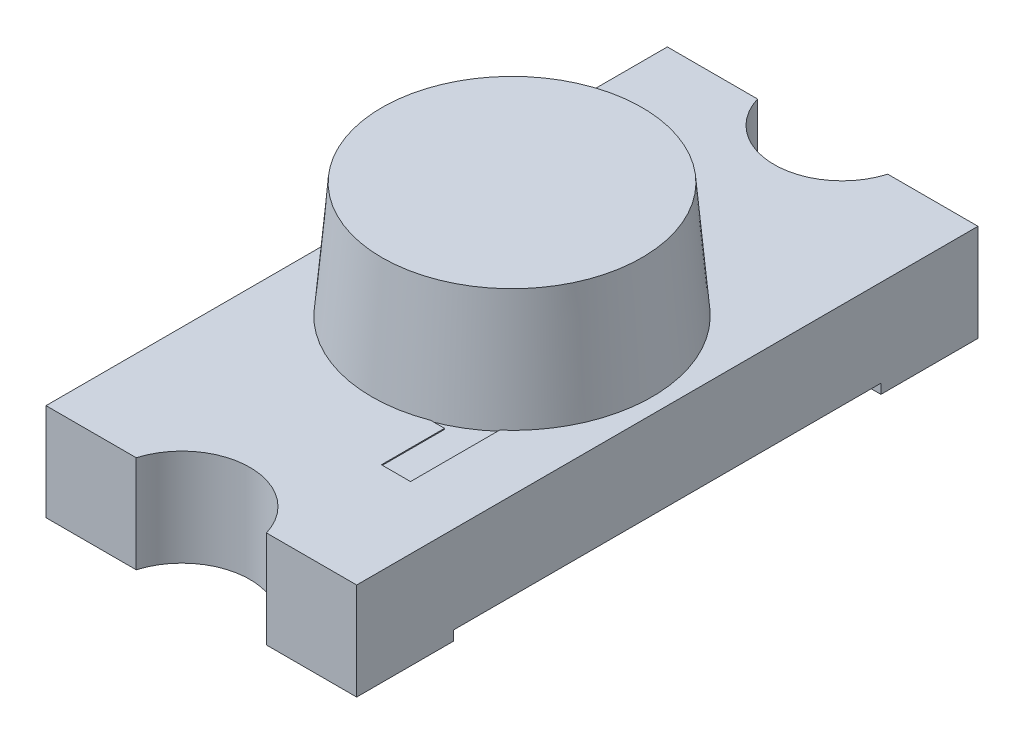
ISO-10303-21;
HEADER;
FILE_DESCRIPTION(('STEP AP214'),'2;1');
FILE_NAME('part.step','',(''),(''),'','','');
FILE_SCHEMA(('AUTOMOTIVE_DESIGN { 1 0 10303 214 1 1 1 1 }'));
ENDSEC;
DATA;
#1=APPLICATION_CONTEXT('core data for automotive mechanical design processes');
#2=APPLICATION_PROTOCOL_DEFINITION('international standard','automotive_design',2000,#1);
#3=PRODUCT_CONTEXT('',#1,'mechanical');
#4=PRODUCT('Part','Part','',(#3));
#5=PRODUCT_RELATED_PRODUCT_CATEGORY('part','',(#4));
#6=PRODUCT_DEFINITION_FORMATION('','',#4);
#7=PRODUCT_DEFINITION_CONTEXT('part definition',#1,'design');
#8=PRODUCT_DEFINITION('design','',#6,#7);
#9=PRODUCT_DEFINITION_SHAPE('','',#8);
#10=(LENGTH_UNIT() NAMED_UNIT(*) SI_UNIT(.MILLI.,.METRE.));
#11=(NAMED_UNIT(*) PLANE_ANGLE_UNIT() SI_UNIT($,.RADIAN.));
#12=(NAMED_UNIT(*) SI_UNIT($,.STERADIAN.) SOLID_ANGLE_UNIT());
#13=UNCERTAINTY_MEASURE_WITH_UNIT(LENGTH_MEASURE(1.E-05),#10,'distance_accuracy_value','');
#14=(GEOMETRIC_REPRESENTATION_CONTEXT(3) GLOBAL_UNCERTAINTY_ASSIGNED_CONTEXT((#13)) GLOBAL_UNIT_ASSIGNED_CONTEXT((#10,
#11,#12)) REPRESENTATION_CONTEXT('',''));
#15=CARTESIAN_POINT('',(0.,0.,0.));
#16=DIRECTION('',(0.,0.,1.));
#17=DIRECTION('',(1.,0.,0.));
#18=AXIS2_PLACEMENT_3D('',#15,#16,#17);
#19=CARTESIAN_POINT('',(0.,0.495,0.));
#20=DIRECTION('',(0.,-1.,0.));
#21=DIRECTION('',(0.,0.,1.));
#22=AXIS2_PLACEMENT_3D('',#19,#20,#21);
#23=CONICAL_SURFACE('',#22,0.722303878658216,0.0872664625997167);
#24=CARTESIAN_POINT('',(0.,1.095,0.));
#25=DIRECTION('',(0.,1.,0.));
#26=DIRECTION('',(0.,0.,1.));
#27=AXIS2_PLACEMENT_3D('',#24,#25,#26);
#28=CIRCLE('',#27,0.669810680542662);
#29=CARTESIAN_POINT('',(0.,1.095,0.669810680542662));
#30=VERTEX_POINT('',#29);
#31=EDGE_CURVE('E12',#30,#30,#28,.T.);
#32=ORIENTED_EDGE('',*,*,#31,.F.);
#33=EDGE_LOOP('',(#32));
#34=FACE_BOUND('',#33,.T.);
#35=CARTESIAN_POINT('',(0.,0.495,0.));
#36=DIRECTION('',(0.,1.,0.));
#37=DIRECTION('',(0.,0.,1.));
#38=AXIS2_PLACEMENT_3D('',#35,#36,#37);
#39=CIRCLE('',#38,0.722303878658216);
#40=CARTESIAN_POINT('',(0.,0.495,0.722303878658216));
#41=VERTEX_POINT('',#40);
#42=EDGE_CURVE('E50',#41,#41,#39,.T.);
#43=ORIENTED_EDGE('',*,*,#42,.T.);
#44=EDGE_LOOP('',(#43));
#45=FACE_BOUND('',#44,.T.);
#46=ADVANCED_FACE('F44',(#34,#45),#23,.T.);
#47=CARTESIAN_POINT('',(0.,1.095,0.));
#48=DIRECTION('',(0.,1.,0.));
#49=DIRECTION('',(0.,0.,1.));
#50=AXIS2_PLACEMENT_3D('',#47,#48,#49);
#51=PLANE('',#50);
#52=ORIENTED_EDGE('',*,*,#31,.T.);
#53=EDGE_LOOP('',(#52));
#54=FACE_BOUND('',#53,.T.);
#55=ADVANCED_FACE('F59',(#54),#51,.T.);
#56=CARTESIAN_POINT('',(0.,0.495,0.));
#57=DIRECTION('',(0.,1.,0.));
#58=DIRECTION('',(0.,0.,1.));
#59=AXIS2_PLACEMENT_3D('',#56,#57,#58);
#60=PLANE('',#59);
#61=ORIENTED_EDGE('',*,*,#42,.F.);
#62=EDGE_LOOP('',(#61));
#63=FACE_BOUND('',#62,.T.);
#64=ADVANCED_FACE('F57',(#63),#60,.F.);
#65=CLOSED_SHELL('',(#46,#55,#64));
#66=MANIFOLD_SOLID_BREP('B2',#65);
#67=CARTESIAN_POINT('',(-2.92422569718548,0.495,0.));
#68=DIRECTION('',(0.,1.,0.));
#69=DIRECTION('',(0.,0.,1.));
#70=AXIS2_PLACEMENT_3D('',#67,#68,#69);
#71=PLANE('',#70);
#72=DIRECTION('',(0.,0.,1.));
#73=VECTOR('',#72,1.);
#74=CARTESIAN_POINT('',(0.477379024541812,0.495,0.));
#75=LINE('',#74,#73);
#76=CARTESIAN_POINT('',(0.477379024541812,0.495,0.525));
#77=VERTEX_POINT('',#76);
#78=CARTESIAN_POINT('',(0.477379024541812,0.495,1.));
#79=VERTEX_POINT('',#78);
#80=EDGE_CURVE('E366',#77,#79,#75,.T.);
#81=ORIENTED_EDGE('',*,*,#80,.F.);
#82=DIRECTION('',(1.,0.,0.));
#83=VECTOR('',#82,1.);
#84=CARTESIAN_POINT('',(-2.92422569718548,0.495,0.525));
#85=LINE('',#84,#83);
#86=CARTESIAN_POINT('',(-0.075,0.495,0.525));
#87=VERTEX_POINT('',#86);
#88=EDGE_CURVE('E368',#87,#77,#85,.T.);
#89=ORIENTED_EDGE('',*,*,#88,.F.);
#90=DIRECTION('',(0.,0.,1.));
#91=VECTOR('',#90,1.);
#92=CARTESIAN_POINT('',(-0.075,0.495,0.));
#93=LINE('',#92,#91);
#94=CARTESIAN_POINT('',(-0.075,0.495,0.225));
#95=VERTEX_POINT('',#94);
#96=EDGE_CURVE('E371',#95,#87,#93,.T.);
#97=ORIENTED_EDGE('',*,*,#96,.F.);
#98=DIRECTION('',(1.,0.,0.));
#99=VECTOR('',#98,1.);
#100=CARTESIAN_POINT('',(-2.92422569718548,0.495,0.225000000000001));
#101=LINE('',#100,#99);
#102=CARTESIAN_POINT('',(0.225,0.495,0.225));
#103=VERTEX_POINT('',#102);
#104=EDGE_CURVE('E373',#95,#103,#101,.T.);
#105=ORIENTED_EDGE('',*,*,#104,.T.);
#106=DIRECTION('',(0.,0.,1.));
#107=VECTOR('',#106,1.);
#108=CARTESIAN_POINT('',(0.225,0.495,0.));
#109=LINE('',#108,#107);
#110=CARTESIAN_POINT('',(0.225,0.495,-0.225));
#111=VERTEX_POINT('',#110);
#112=EDGE_CURVE('E376',#111,#103,#109,.T.);
#113=ORIENTED_EDGE('',*,*,#112,.F.);
#114=DIRECTION('',(1.,0.,0.));
#115=VECTOR('',#114,1.);
#116=CARTESIAN_POINT('',(-2.92422569718548,0.495,-0.225));
#117=LINE('',#116,#115);
#118=CARTESIAN_POINT('',(-0.225,0.495,-0.225));
#119=VERTEX_POINT('',#118);
#120=EDGE_CURVE('E378',#119,#111,#117,.T.);
#121=ORIENTED_EDGE('',*,*,#120,.F.);
#122=DIRECTION('',(0.,0.,1.));
#123=VECTOR('',#122,1.);
#124=CARTESIAN_POINT('',(-0.225,0.495,0.));
#125=LINE('',#124,#123);
#126=CARTESIAN_POINT('',(-0.225,0.495,0.675));
#127=VERTEX_POINT('',#126);
#128=EDGE_CURVE('E380',#119,#127,#125,.T.);
#129=ORIENTED_EDGE('',*,*,#128,.T.);
#130=DIRECTION('',(1.,0.,0.));
#131=VECTOR('',#130,1.);
#132=CARTESIAN_POINT('',(-2.92422569718548,0.495,0.675));
#133=LINE('',#132,#131);
#134=CARTESIAN_POINT('',(0.327379024541811,0.495,0.675));
#135=VERTEX_POINT('',#134);
#136=EDGE_CURVE('E383',#127,#135,#133,.T.);
#137=ORIENTED_EDGE('',*,*,#136,.T.);
#138=DIRECTION('',(0.,0.,1.));
#139=VECTOR('',#138,1.);
#140=CARTESIAN_POINT('',(0.327379024541812,0.495,0.));
#141=LINE('',#140,#139);
#142=CARTESIAN_POINT('',(0.327379024541812,0.495,1.));
#143=VERTEX_POINT('',#142);
#144=EDGE_CURVE('E386',#135,#143,#141,.T.);
#145=ORIENTED_EDGE('',*,*,#144,.T.);
#146=DIRECTION('',(1.,0.,0.));
#147=VECTOR('',#146,1.);
#148=CARTESIAN_POINT('',(-2.92422569718548,0.495,1.));
#149=LINE('',#148,#147);
#150=EDGE_CURVE('E389',#143,#79,#149,.T.);
#151=ORIENTED_EDGE('',*,*,#150,.T.);
#152=EDGE_LOOP('',(#81,#89,#97,#105,#113,#121,#129,#137,#145,#151));
#153=FACE_BOUND('',#152,.T.);
#154=DIRECTION('',(1.,0.,0.));
#155=VECTOR('',#154,1.);
#156=CARTESIAN_POINT('',(-0.195,0.495,0.195));
#157=LINE('',#156,#155);
#158=CARTESIAN_POINT('',(-0.195,0.495,0.195));
#159=VERTEX_POINT('',#158);
#160=CARTESIAN_POINT('',(0.195,0.495,0.195));
#161=VERTEX_POINT('',#160);
#162=EDGE_CURVE('E961',#159,#161,#157,.T.);
#163=ORIENTED_EDGE('',*,*,#162,.F.);
#164=DIRECTION('',(0.,0.,1.));
#165=VECTOR('',#164,1.);
#166=CARTESIAN_POINT('',(-0.195,0.495,-0.195));
#167=LINE('',#166,#165);
#168=CARTESIAN_POINT('',(-0.195,0.495,-0.195));
#169=VERTEX_POINT('',#168);
#170=EDGE_CURVE('E316',#169,#159,#167,.T.);
#171=ORIENTED_EDGE('',*,*,#170,.F.);
#172=DIRECTION('',(-1.,0.,0.));
#173=VECTOR('',#172,1.);
#174=CARTESIAN_POINT('',(-0.195,0.495,-0.195));
#175=LINE('',#174,#173);
#176=CARTESIAN_POINT('',(0.195,0.495,-0.195));
#177=VERTEX_POINT('',#176);
#178=EDGE_CURVE('E312',#177,#169,#175,.T.);
#179=ORIENTED_EDGE('',*,*,#178,.F.);
#180=DIRECTION('',(0.,0.,-1.));
#181=VECTOR('',#180,1.);
#182=CARTESIAN_POINT('',(0.195,0.495,-0.195));
#183=LINE('',#182,#181);
#184=EDGE_CURVE('E958',#161,#177,#183,.T.);
#185=ORIENTED_EDGE('',*,*,#184,.F.);
#186=EDGE_LOOP('',(#163,#171,#179,#185));
#187=FACE_BOUND('',#186,.T.);
#188=ADVANCED_FACE('F85',(#153,#187),#71,.T.);
#189=CARTESIAN_POINT('',(0.8,0.5,1.6));
#190=DIRECTION('',(0.,-1.,0.));
#191=DIRECTION('',(0.,0.,-1.));
#192=AXIS2_PLACEMENT_3D('',#189,#190,#191);
#193=PLANE('',#192);
#194=DIRECTION('',(0.,0.,-1.));
#195=VECTOR('',#194,1.);
#196=CARTESIAN_POINT('',(0.276447509101705,0.5,0.));
#197=LINE('',#196,#195);
#198=CARTESIAN_POINT('',(0.276447509101705,0.5,-0.450698671652405));
#199=VERTEX_POINT('',#198);
#200=CARTESIAN_POINT('',(0.276447509101705,0.5,-0.630698671652405));
#201=VERTEX_POINT('',#200);
#202=EDGE_CURVE('E319',#199,#201,#197,.T.);
#203=ORIENTED_EDGE('',*,*,#202,.F.);
#204=DIRECTION('',(1.,0.,0.));
#205=VECTOR('',#204,1.);
#206=CARTESIAN_POINT('',(-2.92422569718548,0.5,-0.450698671652405));
#207=LINE('',#206,#205);
#208=CARTESIAN_POINT('',(-0.457414609839892,0.5,-0.450698671652405));
#209=VERTEX_POINT('',#208);
#210=EDGE_CURVE('E108',#209,#199,#207,.T.);
#211=ORIENTED_EDGE('',*,*,#210,.F.);
#212=DIRECTION('',(0.,0.,1.));
#213=VECTOR('',#212,1.);
#214=CARTESIAN_POINT('',(-0.457414609839892,0.5,0.));
#215=LINE('',#214,#213);
#216=CARTESIAN_POINT('',(-0.457414609839892,0.5,-1.));
#217=VERTEX_POINT('',#216);
#218=EDGE_CURVE('E328',#217,#209,#215,.T.);
#219=ORIENTED_EDGE('',*,*,#218,.F.);
#220=DIRECTION('',(1.,0.,0.));
#221=VECTOR('',#220,1.);
#222=CARTESIAN_POINT('',(-2.92422569718548,0.5,-1.));
#223=LINE('',#222,#221);
#224=CARTESIAN_POINT('',(-0.277414609839892,0.5,-1.));
#225=VERTEX_POINT('',#224);
#226=EDGE_CURVE('E349',#217,#225,#223,.T.);
#227=ORIENTED_EDGE('',*,*,#226,.T.);
#228=DIRECTION('',(0.,0.,1.));
#229=VECTOR('',#228,1.);
#230=CARTESIAN_POINT('',(-0.277414609839892,0.5,0.));
#231=LINE('',#230,#229);
#232=CARTESIAN_POINT('',(-0.277414609839892,0.5,-0.630698671652405));
#233=VERTEX_POINT('',#232);
#234=EDGE_CURVE('E346',#225,#233,#231,.T.);
#235=ORIENTED_EDGE('',*,*,#234,.T.);
#236=DIRECTION('',(1.,0.,0.));
#237=VECTOR('',#236,1.);
#238=CARTESIAN_POINT('',(-2.92422569718548,0.5,-0.630698671652405));
#239=LINE('',#238,#237);
#240=EDGE_CURVE('E343',#233,#201,#239,.T.);
#241=ORIENTED_EDGE('',*,*,#240,.T.);
#242=EDGE_LOOP('',(#203,#211,#219,#227,#235,#241));
#243=FACE_BOUND('',#242,.T.);
#244=CARTESIAN_POINT('',(0.,0.500000000000001,1.7));
#245=DIRECTION('',(0.,1.,0.));
#246=DIRECTION('',(0.,0.,1.));
#247=AXIS2_PLACEMENT_3D('',#244,#245,#246);
#248=CIRCLE('',#247,0.35);
#249=CARTESIAN_POINT('',(0.335410196624969,0.500000000000001,1.6));
#250=VERTEX_POINT('',#249);
#251=CARTESIAN_POINT('',(-0.335410196624969,0.500000000000001,1.6));
#252=VERTEX_POINT('',#251);
#253=EDGE_CURVE('E442',#250,#252,#248,.T.);
#254=ORIENTED_EDGE('',*,*,#253,.F.);
#255=DIRECTION('',(-1.,0.,0.));
#256=VECTOR('',#255,1.);
#257=CARTESIAN_POINT('',(0.8,0.5,1.6));
#258=LINE('',#257,#256);
#259=CARTESIAN_POINT('',(0.8,0.5,1.6));
#260=VERTEX_POINT('',#259);
#261=EDGE_CURVE('E499',#260,#250,#258,.T.);
#262=ORIENTED_EDGE('',*,*,#261,.F.);
#263=DIRECTION('',(0.,0.,1.));
#264=VECTOR('',#263,1.);
#265=CARTESIAN_POINT('',(0.8,0.5,1.6));
#266=LINE('',#265,#264);
#267=CARTESIAN_POINT('',(0.8,0.500000000000001,-1.6));
#268=VERTEX_POINT('',#267);
#269=EDGE_CURVE('E496',#268,#260,#266,.T.);
#270=ORIENTED_EDGE('',*,*,#269,.F.);
#271=DIRECTION('',(-1.,0.,0.));
#272=VECTOR('',#271,1.);
#273=CARTESIAN_POINT('',(0.8,0.500000000000001,-1.6));
#274=LINE('',#273,#272);
#275=CARTESIAN_POINT('',(0.335410196624969,0.500000000000001,-1.6));
#276=VERTEX_POINT('',#275);
#277=EDGE_CURVE('E503',#268,#276,#274,.T.);
#278=ORIENTED_EDGE('',*,*,#277,.T.);
#279=CARTESIAN_POINT('',(0.,0.500000000000001,-1.7));
#280=DIRECTION('',(0.,-1.,0.));
#281=DIRECTION('',(0.,0.,-1.));
#282=AXIS2_PLACEMENT_3D('',#279,#280,#281);
#283=CIRCLE('',#282,0.35);
#284=CARTESIAN_POINT('',(-0.335410196624969,0.500000000000001,-1.6));
#285=VERTEX_POINT('',#284);
#286=EDGE_CURVE('E42',#285,#276,#283,.F.);
#287=ORIENTED_EDGE('',*,*,#286,.F.);
#288=CARTESIAN_POINT('',(-0.8,0.500000000000001,-1.6));
#289=VERTEX_POINT('',#288);
#290=EDGE_CURVE('E502',#285,#289,#274,.T.);
#291=ORIENTED_EDGE('',*,*,#290,.T.);
#292=DIRECTION('',(0.,0.,1.));
#293=VECTOR('',#292,1.);
#294=CARTESIAN_POINT('',(-0.8,0.5,1.6));
#295=LINE('',#294,#293);
#296=CARTESIAN_POINT('',(-0.8,0.5,1.6));
#297=VERTEX_POINT('',#296);
#298=EDGE_CURVE('E478',#289,#297,#295,.T.);
#299=ORIENTED_EDGE('',*,*,#298,.T.);
#300=EDGE_CURVE('E498',#252,#297,#258,.T.);
#301=ORIENTED_EDGE('',*,*,#300,.F.);
#302=EDGE_LOOP('',(#254,#262,#270,#278,#287,#291,#299,#301));
#303=FACE_BOUND('',#302,.T.);
#304=DIRECTION('',(0.,0.,1.));
#305=VECTOR('',#304,1.);
#306=CARTESIAN_POINT('',(0.477379024541812,0.5,0.));
#307=LINE('',#306,#305);
#308=CARTESIAN_POINT('',(0.477379024541812,0.5,0.525));
#309=VERTEX_POINT('',#308);
#310=CARTESIAN_POINT('',(0.477379024541812,0.5,1.));
#311=VERTEX_POINT('',#310);
#312=EDGE_CURVE('E356',#309,#311,#307,.T.);
#313=ORIENTED_EDGE('',*,*,#312,.T.);
#314=DIRECTION('',(1.,0.,0.));
#315=VECTOR('',#314,1.);
#316=CARTESIAN_POINT('',(-2.92422569718548,0.5,1.));
#317=LINE('',#316,#315);
#318=CARTESIAN_POINT('',(0.327379024541812,0.5,1.));
#319=VERTEX_POINT('',#318);
#320=EDGE_CURVE('E369',#319,#311,#317,.T.);
#321=ORIENTED_EDGE('',*,*,#320,.F.);
#322=DIRECTION('',(0.,0.,1.));
#323=VECTOR('',#322,1.);
#324=CARTESIAN_POINT('',(0.327379024541812,0.5,0.));
#325=LINE('',#324,#323);
#326=CARTESIAN_POINT('',(0.327379024541811,0.5,0.675));
#327=VERTEX_POINT('',#326);
#328=EDGE_CURVE('E416',#327,#319,#325,.T.);
#329=ORIENTED_EDGE('',*,*,#328,.F.);
#330=DIRECTION('',(1.,0.,0.));
#331=VECTOR('',#330,1.);
#332=CARTESIAN_POINT('',(-2.92422569718548,0.5,0.675));
#333=LINE('',#332,#331);
#334=CARTESIAN_POINT('',(-0.225,0.5,0.675));
#335=VERTEX_POINT('',#334);
#336=EDGE_CURVE('E413',#335,#327,#333,.T.);
#337=ORIENTED_EDGE('',*,*,#336,.F.);
#338=DIRECTION('',(0.,0.,1.));
#339=VECTOR('',#338,1.);
#340=CARTESIAN_POINT('',(-0.225,0.5,0.));
#341=LINE('',#340,#339);
#342=CARTESIAN_POINT('',(-0.225,0.5,-0.225));
#343=VERTEX_POINT('',#342);
#344=EDGE_CURVE('E410',#343,#335,#341,.T.);
#345=ORIENTED_EDGE('',*,*,#344,.F.);
#346=DIRECTION('',(1.,0.,0.));
#347=VECTOR('',#346,1.);
#348=CARTESIAN_POINT('',(-2.92422569718548,0.5,-0.225));
#349=LINE('',#348,#347);
#350=CARTESIAN_POINT('',(0.225,0.5,-0.225));
#351=VERTEX_POINT('',#350);
#352=EDGE_CURVE('E407',#343,#351,#349,.T.);
#353=ORIENTED_EDGE('',*,*,#352,.T.);
#354=DIRECTION('',(0.,0.,1.));
#355=VECTOR('',#354,1.);
#356=CARTESIAN_POINT('',(0.225,0.5,0.));
#357=LINE('',#356,#355);
#358=CARTESIAN_POINT('',(0.225,0.5,0.225));
#359=VERTEX_POINT('',#358);
#360=EDGE_CURVE('E404',#351,#359,#357,.T.);
#361=ORIENTED_EDGE('',*,*,#360,.T.);
#362=DIRECTION('',(1.,0.,0.));
#363=VECTOR('',#362,1.);
#364=CARTESIAN_POINT('',(-2.92422569718548,0.5,0.225000000000001));
#365=LINE('',#364,#363);
#366=CARTESIAN_POINT('',(-0.075,0.5,0.225));
#367=VERTEX_POINT('',#366);
#368=EDGE_CURVE('E401',#367,#359,#365,.T.);
#369=ORIENTED_EDGE('',*,*,#368,.F.);
#370=DIRECTION('',(0.,0.,1.));
#371=VECTOR('',#370,1.);
#372=CARTESIAN_POINT('',(-0.075,0.5,0.));
#373=LINE('',#372,#371);
#374=CARTESIAN_POINT('',(-0.075,0.5,0.525));
#375=VERTEX_POINT('',#374);
#376=EDGE_CURVE('E398',#367,#375,#373,.T.);
#377=ORIENTED_EDGE('',*,*,#376,.T.);
#378=DIRECTION('',(1.,0.,0.));
#379=VECTOR('',#378,1.);
#380=CARTESIAN_POINT('',(-2.92422569718548,0.5,0.525));
#381=LINE('',#380,#379);
#382=EDGE_CURVE('E395',#375,#309,#381,.T.);
#383=ORIENTED_EDGE('',*,*,#382,.T.);
#384=EDGE_LOOP('',(#313,#321,#329,#337,#345,#353,#361,#369,#377,#383));
#385=FACE_BOUND('',#384,.T.);
#386=ADVANCED_FACE('F537',(#243,#303,#385),#193,.F.);
#387=CARTESIAN_POINT('',(0.8,0.5,1.6));
#388=DIRECTION('',(0.,0.,-1.));
#389=DIRECTION('',(0.,1.,0.));
#390=AXIS2_PLACEMENT_3D('',#387,#388,#389);
#391=PLANE('',#390);
#392=DIRECTION('',(0.,-1.,0.));
#393=VECTOR('',#392,1.);
#394=CARTESIAN_POINT('',(0.335410196624969,0.500000000000001,1.6));
#395=LINE('',#394,#393);
#396=CARTESIAN_POINT('',(0.335410196624969,0.,1.6));
#397=VERTEX_POINT('',#396);
#398=EDGE_CURVE('E448',#397,#250,#395,.F.);
#399=ORIENTED_EDGE('',*,*,#398,.F.);
#400=DIRECTION('',(-1.,0.,0.));
#401=VECTOR('',#400,1.);
#402=CARTESIAN_POINT('',(0.8,0.,1.6));
#403=LINE('',#402,#401);
#404=CARTESIAN_POINT('',(0.8,0.,1.6));
#405=VERTEX_POINT('',#404);
#406=EDGE_CURVE('E93',#405,#397,#403,.T.);
#407=ORIENTED_EDGE('',*,*,#406,.F.);
#408=DIRECTION('',(0.,-1.,0.));
#409=VECTOR('',#408,1.);
#410=CARTESIAN_POINT('',(0.8,0.5,1.6));
#411=LINE('',#410,#409);
#412=EDGE_CURVE('E481',#260,#405,#411,.T.);
#413=ORIENTED_EDGE('',*,*,#412,.F.);
#414=ORIENTED_EDGE('',*,*,#261,.T.);
#415=EDGE_LOOP('',(#399,#407,#413,#414));
#416=FACE_BOUND('',#415,.T.);
#417=ADVANCED_FACE('F87',(#416),#391,.F.);
#418=DIRECTION('',(0.,-1.,0.));
#419=VECTOR('',#418,1.);
#420=CARTESIAN_POINT('',(-0.335410196624969,0.500000000000001,1.6));
#421=LINE('',#420,#419);
#422=CARTESIAN_POINT('',(-0.335410196624969,0.,1.6));
#423=VERTEX_POINT('',#422);
#424=EDGE_CURVE('E444',#252,#423,#421,.T.);
#425=ORIENTED_EDGE('',*,*,#424,.F.);
#426=ORIENTED_EDGE('',*,*,#300,.T.);
#427=DIRECTION('',(0.,-1.,0.));
#428=VECTOR('',#427,1.);
#429=CARTESIAN_POINT('',(-0.8,0.5,1.6));
#430=LINE('',#429,#428);
#431=CARTESIAN_POINT('',(-0.8,0.,1.6));
#432=VERTEX_POINT('',#431);
#433=EDGE_CURVE('E457',#297,#432,#430,.T.);
#434=ORIENTED_EDGE('',*,*,#433,.T.);
#435=EDGE_CURVE('E517',#423,#432,#403,.T.);
#436=ORIENTED_EDGE('',*,*,#435,.F.);
#437=EDGE_LOOP('',(#425,#426,#434,#436));
#438=FACE_BOUND('',#437,.T.);
#439=ADVANCED_FACE('F533',(#438),#391,.F.);
#440=CARTESIAN_POINT('',(0.8,0.,1.6));
#441=DIRECTION('',(0.,1.,0.));
#442=DIRECTION('',(0.,0.,1.));
#443=AXIS2_PLACEMENT_3D('',#440,#441,#442);
#444=PLANE('',#443);
#445=CARTESIAN_POINT('',(0.,0.,1.7));
#446=DIRECTION('',(0.,1.,0.));
#447=DIRECTION('',(0.,0.,1.));
#448=AXIS2_PLACEMENT_3D('',#445,#446,#447);
#449=CIRCLE('',#448,0.35);
#450=EDGE_CURVE('E423',#397,#423,#449,.T.);
#451=ORIENTED_EDGE('',*,*,#450,.T.);
#452=ORIENTED_EDGE('',*,*,#435,.T.);
#453=DIRECTION('',(0.,0.,-1.));
#454=VECTOR('',#453,1.);
#455=CARTESIAN_POINT('',(-0.8,0.,1.6));
#456=LINE('',#455,#454);
#457=CARTESIAN_POINT('',(-0.8,0.,1.1));
#458=VERTEX_POINT('',#457);
#459=EDGE_CURVE('E460',#432,#458,#456,.T.);
#460=ORIENTED_EDGE('',*,*,#459,.T.);
#461=DIRECTION('',(-1.,0.,0.));
#462=VECTOR('',#461,1.);
#463=CARTESIAN_POINT('',(0.8,0.,1.1));
#464=LINE('',#463,#462);
#465=CARTESIAN_POINT('',(0.8,0.,1.1));
#466=VERTEX_POINT('',#465);
#467=EDGE_CURVE('E516',#466,#458,#464,.T.);
#468=ORIENTED_EDGE('',*,*,#467,.F.);
#469=DIRECTION('',(0.,0.,-1.));
#470=VECTOR('',#469,1.);
#471=CARTESIAN_POINT('',(0.8,0.,1.6));
#472=LINE('',#471,#470);
#473=EDGE_CURVE('E484',#405,#466,#472,.T.);
#474=ORIENTED_EDGE('',*,*,#473,.F.);
#475=ORIENTED_EDGE('',*,*,#406,.T.);
#476=EDGE_LOOP('',(#451,#452,#460,#468,#474,#475));
#477=FACE_BOUND('',#476,.T.);
#478=ADVANCED_FACE('F523',(#477),#444,.F.);
#479=CARTESIAN_POINT('',(0.8,0.,-1.1));
#480=DIRECTION('',(0.,1.,0.));
#481=DIRECTION('',(0.,0.,1.));
#482=AXIS2_PLACEMENT_3D('',#479,#480,#481);
#483=PLANE('',#482);
#484=CARTESIAN_POINT('',(0.,0.,-1.7));
#485=DIRECTION('',(0.,1.,0.));
#486=DIRECTION('',(0.,0.,1.));
#487=AXIS2_PLACEMENT_3D('',#484,#485,#486);
#488=CIRCLE('',#487,0.35);
#489=CARTESIAN_POINT('',(-0.335410196624969,0.,-1.6));
#490=VERTEX_POINT('',#489);
#491=CARTESIAN_POINT('',(0.335410196624969,0.,-1.6));
#492=VERTEX_POINT('',#491);
#493=EDGE_CURVE('E450',#490,#492,#488,.T.);
#494=ORIENTED_EDGE('',*,*,#493,.T.);
#495=DIRECTION('',(-1.,0.,0.));
#496=VECTOR('',#495,1.);
#497=CARTESIAN_POINT('',(0.8,0.,-1.6));
#498=LINE('',#497,#496);
#499=CARTESIAN_POINT('',(0.8,0.,-1.6));
#500=VERTEX_POINT('',#499);
#501=EDGE_CURVE('E507',#500,#492,#498,.T.);
#502=ORIENTED_EDGE('',*,*,#501,.F.);
#503=DIRECTION('',(0.,0.,-1.));
#504=VECTOR('',#503,1.);
#505=CARTESIAN_POINT('',(0.8,0.,-1.1));
#506=LINE('',#505,#504);
#507=CARTESIAN_POINT('',(0.8,0.,-1.1));
#508=VERTEX_POINT('',#507);
#509=EDGE_CURVE('E492',#508,#500,#506,.T.);
#510=ORIENTED_EDGE('',*,*,#509,.F.);
#511=DIRECTION('',(-1.,0.,0.));
#512=VECTOR('',#511,1.);
#513=CARTESIAN_POINT('',(0.8,0.,-1.1));
#514=LINE('',#513,#512);
#515=CARTESIAN_POINT('',(-0.8,0.,-1.1));
#516=VERTEX_POINT('',#515);
#517=EDGE_CURVE('E510',#508,#516,#514,.T.);
#518=ORIENTED_EDGE('',*,*,#517,.T.);
#519=DIRECTION('',(0.,0.,-1.));
#520=VECTOR('',#519,1.);
#521=CARTESIAN_POINT('',(-0.8,0.,-1.1));
#522=LINE('',#521,#520);
#523=CARTESIAN_POINT('',(-0.8,0.,-1.6));
#524=VERTEX_POINT('',#523);
#525=EDGE_CURVE('E472',#516,#524,#522,.T.);
#526=ORIENTED_EDGE('',*,*,#525,.T.);
#527=EDGE_CURVE('E506',#490,#524,#498,.T.);
#528=ORIENTED_EDGE('',*,*,#527,.F.);
#529=EDGE_LOOP('',(#494,#502,#510,#518,#526,#528));
#530=FACE_BOUND('',#529,.T.);
#531=ADVANCED_FACE('F548',(#530),#483,.F.);
#532=CARTESIAN_POINT('',(0.8,0.500000000000001,-1.6));
#533=DIRECTION('',(0.,0.,1.));
#534=DIRECTION('',(0.,-1.,0.));
#535=AXIS2_PLACEMENT_3D('',#532,#533,#534);
#536=PLANE('',#535);
#537=DIRECTION('',(0.,-1.,0.));
#538=VECTOR('',#537,1.);
#539=CARTESIAN_POINT('',(-0.335410196624969,0.500000000000001,-1.6));
#540=LINE('',#539,#538);
#541=EDGE_CURVE('E455',#490,#285,#540,.F.);
#542=ORIENTED_EDGE('',*,*,#541,.F.);
#543=ORIENTED_EDGE('',*,*,#527,.T.);
#544=DIRECTION('',(0.,1.,0.));
#545=VECTOR('',#544,1.);
#546=CARTESIAN_POINT('',(-0.8,0.500000000000001,-1.6));
#547=LINE('',#546,#545);
#548=EDGE_CURVE('E475',#524,#289,#547,.T.);
#549=ORIENTED_EDGE('',*,*,#548,.T.);
#550=ORIENTED_EDGE('',*,*,#290,.F.);
#551=EDGE_LOOP('',(#542,#543,#549,#550));
#552=FACE_BOUND('',#551,.T.);
#553=ADVANCED_FACE('F863',(#552),#536,.F.);
#554=DIRECTION('',(0.,-1.,0.));
#555=VECTOR('',#554,1.);
#556=CARTESIAN_POINT('',(0.335410196624969,0.500000000000001,-1.6));
#557=LINE('',#556,#555);
#558=EDGE_CURVE('E453',#276,#492,#557,.T.);
#559=ORIENTED_EDGE('',*,*,#558,.F.);
#560=ORIENTED_EDGE('',*,*,#277,.F.);
#561=DIRECTION('',(0.,1.,0.));
#562=VECTOR('',#561,1.);
#563=CARTESIAN_POINT('',(0.8,0.500000000000001,-1.6));
#564=LINE('',#563,#562);
#565=EDGE_CURVE('E494',#500,#268,#564,.T.);
#566=ORIENTED_EDGE('',*,*,#565,.F.);
#567=ORIENTED_EDGE('',*,*,#501,.T.);
#568=EDGE_LOOP('',(#559,#560,#566,#567));
#569=FACE_BOUND('',#568,.T.);
#570=ADVANCED_FACE('F858',(#569),#536,.F.);
#571=CARTESIAN_POINT('',(0.8,0.0500000000000005,1.1));
#572=DIRECTION('',(0.,0.,1.));
#573=DIRECTION('',(1.,0.,0.));
#574=AXIS2_PLACEMENT_3D('',#571,#572,#573);
#575=PLANE('',#574);
#576=ORIENTED_EDGE('',*,*,#467,.T.);
#577=DIRECTION('',(0.,1.,0.));
#578=VECTOR('',#577,1.);
#579=CARTESIAN_POINT('',(-0.8,0.0500000000000005,1.1));
#580=LINE('',#579,#578);
#581=CARTESIAN_POINT('',(-0.8,0.0500000000000005,1.1));
#582=VERTEX_POINT('',#581);
#583=EDGE_CURVE('E463',#458,#582,#580,.T.);
#584=ORIENTED_EDGE('',*,*,#583,.T.);
#585=DIRECTION('',(-1.,0.,0.));
#586=VECTOR('',#585,1.);
#587=CARTESIAN_POINT('',(0.8,0.0500000000000005,1.1));
#588=LINE('',#587,#586);
#589=CARTESIAN_POINT('',(0.8,0.0500000000000005,1.1));
#590=VERTEX_POINT('',#589);
#591=EDGE_CURVE('E514',#590,#582,#588,.T.);
#592=ORIENTED_EDGE('',*,*,#591,.F.);
#593=DIRECTION('',(0.,1.,0.));
#594=VECTOR('',#593,1.);
#595=CARTESIAN_POINT('',(0.8,0.0500000000000005,1.1));
#596=LINE('',#595,#594);
#597=EDGE_CURVE('E486',#466,#590,#596,.T.);
#598=ORIENTED_EDGE('',*,*,#597,.F.);
#599=EDGE_LOOP('',(#576,#584,#592,#598));
#600=FACE_BOUND('',#599,.T.);
#601=ADVANCED_FACE('F562',(#600),#575,.F.);
#602=CARTESIAN_POINT('',(0.8,0.0500000000000005,1.1));
#603=DIRECTION('',(0.,1.,0.));
#604=DIRECTION('',(0.,0.,1.));
#605=AXIS2_PLACEMENT_3D('',#602,#603,#604);
#606=PLANE('',#605);
#607=ORIENTED_EDGE('',*,*,#591,.T.);
#608=DIRECTION('',(0.,0.,-1.));
#609=VECTOR('',#608,1.);
#610=CARTESIAN_POINT('',(-0.8,0.0500000000000005,1.1));
#611=LINE('',#610,#609);
#612=CARTESIAN_POINT('',(-0.8,0.0500000000000005,-1.1));
#613=VERTEX_POINT('',#612);
#614=EDGE_CURVE('E466',#582,#613,#611,.T.);
#615=ORIENTED_EDGE('',*,*,#614,.T.);
#616=DIRECTION('',(-1.,0.,0.));
#617=VECTOR('',#616,1.);
#618=CARTESIAN_POINT('',(0.8,0.0500000000000005,-1.1));
#619=LINE('',#618,#617);
#620=CARTESIAN_POINT('',(0.8,0.0500000000000005,-1.1));
#621=VERTEX_POINT('',#620);
#622=EDGE_CURVE('E512',#621,#613,#619,.T.);
#623=ORIENTED_EDGE('',*,*,#622,.F.);
#624=DIRECTION('',(0.,0.,-1.));
#625=VECTOR('',#624,1.);
#626=CARTESIAN_POINT('',(0.8,0.0500000000000005,1.1));
#627=LINE('',#626,#625);
#628=EDGE_CURVE('E488',#590,#621,#627,.T.);
#629=ORIENTED_EDGE('',*,*,#628,.F.);
#630=EDGE_LOOP('',(#607,#615,#623,#629));
#631=FACE_BOUND('',#630,.T.);
#632=ADVANCED_FACE('F557',(#631),#606,.F.);
#633=CARTESIAN_POINT('',(0.8,0.0500000000000005,-1.1));
#634=DIRECTION('',(0.,0.,-1.));
#635=DIRECTION('',(-1.,0.,0.));
#636=AXIS2_PLACEMENT_3D('',#633,#634,#635);
#637=PLANE('',#636);
#638=ORIENTED_EDGE('',*,*,#622,.T.);
#639=DIRECTION('',(0.,-1.,0.));
#640=VECTOR('',#639,1.);
#641=CARTESIAN_POINT('',(-0.8,0.0500000000000005,-1.1));
#642=LINE('',#641,#640);
#643=EDGE_CURVE('E469',#613,#516,#642,.T.);
#644=ORIENTED_EDGE('',*,*,#643,.T.);
#645=ORIENTED_EDGE('',*,*,#517,.F.);
#646=DIRECTION('',(0.,-1.,0.));
#647=VECTOR('',#646,1.);
#648=CARTESIAN_POINT('',(0.8,0.0500000000000005,-1.1));
#649=LINE('',#648,#647);
#650=EDGE_CURVE('E490',#621,#508,#649,.T.);
#651=ORIENTED_EDGE('',*,*,#650,.F.);
#652=EDGE_LOOP('',(#638,#644,#645,#651));
#653=FACE_BOUND('',#652,.T.);
#654=ADVANCED_FACE('F554',(#653),#637,.F.);
#655=CARTESIAN_POINT('',(0.8,0.5,1.6));
#656=DIRECTION('',(1.,0.,0.));
#657=DIRECTION('',(0.,0.,-1.));
#658=AXIS2_PLACEMENT_3D('',#655,#656,#657);
#659=PLANE('',#658);
#660=ORIENTED_EDGE('',*,*,#412,.T.);
#661=ORIENTED_EDGE('',*,*,#473,.T.);
#662=ORIENTED_EDGE('',*,*,#597,.T.);
#663=ORIENTED_EDGE('',*,*,#628,.T.);
#664=ORIENTED_EDGE('',*,*,#650,.T.);
#665=ORIENTED_EDGE('',*,*,#509,.T.);
#666=ORIENTED_EDGE('',*,*,#565,.T.);
#667=ORIENTED_EDGE('',*,*,#269,.T.);
#668=EDGE_LOOP('',(#660,#661,#662,#663,#664,#665,#666,#667));
#669=FACE_BOUND('',#668,.T.);
#670=ADVANCED_FACE('F565',(#669),#659,.T.);
#671=CARTESIAN_POINT('',(-0.8,0.5,1.6));
#672=DIRECTION('',(1.,0.,0.));
#673=DIRECTION('',(0.,0.,-1.));
#674=AXIS2_PLACEMENT_3D('',#671,#672,#673);
#675=PLANE('',#674);
#676=ORIENTED_EDGE('',*,*,#433,.F.);
#677=ORIENTED_EDGE('',*,*,#298,.F.);
#678=ORIENTED_EDGE('',*,*,#548,.F.);
#679=ORIENTED_EDGE('',*,*,#525,.F.);
#680=ORIENTED_EDGE('',*,*,#643,.F.);
#681=ORIENTED_EDGE('',*,*,#614,.F.);
#682=ORIENTED_EDGE('',*,*,#583,.F.);
#683=ORIENTED_EDGE('',*,*,#459,.F.);
#684=EDGE_LOOP('',(#676,#677,#678,#679,#680,#681,#682,#683));
#685=FACE_BOUND('',#684,.T.);
#686=ADVANCED_FACE('F530',(#685),#675,.F.);
#687=CARTESIAN_POINT('',(0.,0.500000000000001,-1.7));
#688=DIRECTION('',(0.,-1.,0.));
#689=DIRECTION('',(0.,0.,-1.));
#690=AXIS2_PLACEMENT_3D('',#687,#688,#689);
#691=CYLINDRICAL_SURFACE('',#690,0.35);
#692=ORIENTED_EDGE('',*,*,#541,.T.);
#693=ORIENTED_EDGE('',*,*,#286,.T.);
#694=ORIENTED_EDGE('',*,*,#558,.T.);
#695=ORIENTED_EDGE('',*,*,#493,.F.);
#696=EDGE_LOOP('',(#692,#693,#694,#695));
#697=FACE_BOUND('',#696,.T.);
#698=ADVANCED_FACE('F573',(#697),#691,.F.);
#699=CARTESIAN_POINT('',(0.,0.500000000000001,1.7));
#700=DIRECTION('',(0.,-1.,0.));
#701=DIRECTION('',(0.,0.,-1.));
#702=AXIS2_PLACEMENT_3D('',#699,#700,#701);
#703=CYLINDRICAL_SURFACE('',#702,0.35);
#704=ORIENTED_EDGE('',*,*,#398,.T.);
#705=ORIENTED_EDGE('',*,*,#253,.T.);
#706=ORIENTED_EDGE('',*,*,#424,.T.);
#707=ORIENTED_EDGE('',*,*,#450,.F.);
#708=EDGE_LOOP('',(#704,#705,#706,#707));
#709=FACE_BOUND('',#708,.T.);
#710=ADVANCED_FACE('F570',(#709),#703,.F.);
#711=CARTESIAN_POINT('',(0.477379024541812,0.495,0.));
#712=DIRECTION('',(-1.,0.,0.));
#713=DIRECTION('',(0.,0.,1.));
#714=AXIS2_PLACEMENT_3D('',#711,#712,#713);
#715=PLANE('',#714);
#716=ORIENTED_EDGE('',*,*,#312,.F.);
#717=DIRECTION('',(0.,1.,0.));
#718=VECTOR('',#717,1.);
#719=CARTESIAN_POINT('',(0.477379024541812,0.495,0.525));
#720=LINE('',#719,#718);
#721=EDGE_CURVE('E392',#77,#309,#720,.T.);
#722=ORIENTED_EDGE('',*,*,#721,.F.);
#723=ORIENTED_EDGE('',*,*,#80,.T.);
#724=DIRECTION('',(0.,1.,0.));
#725=VECTOR('',#724,1.);
#726=CARTESIAN_POINT('',(0.477379024541812,0.495,1.));
#727=LINE('',#726,#725);
#728=EDGE_CURVE('E421',#79,#311,#727,.T.);
#729=ORIENTED_EDGE('',*,*,#728,.T.);
#730=EDGE_LOOP('',(#716,#722,#723,#729));
#731=FACE_BOUND('',#730,.T.);
#732=ADVANCED_FACE('F572',(#731),#715,.T.);
#733=CARTESIAN_POINT('',(-2.92422569718548,0.495,1.));
#734=DIRECTION('',(0.,0.,1.));
#735=DIRECTION('',(0.,-1.,0.));
#736=AXIS2_PLACEMENT_3D('',#733,#734,#735);
#737=PLANE('',#736);
#738=ORIENTED_EDGE('',*,*,#320,.T.);
#739=ORIENTED_EDGE('',*,*,#728,.F.);
#740=ORIENTED_EDGE('',*,*,#150,.F.);
#741=DIRECTION('',(0.,1.,0.));
#742=VECTOR('',#741,1.);
#743=CARTESIAN_POINT('',(0.327379024541812,0.495,1.));
#744=LINE('',#743,#742);
#745=EDGE_CURVE('E424',#143,#319,#744,.T.);
#746=ORIENTED_EDGE('',*,*,#745,.T.);
#747=EDGE_LOOP('',(#738,#739,#740,#746));
#748=FACE_BOUND('',#747,.T.);
#749=ADVANCED_FACE('F579',(#748),#737,.F.);
#750=CARTESIAN_POINT('',(0.327379024541812,0.495,0.));
#751=DIRECTION('',(-1.,0.,0.));
#752=DIRECTION('',(0.,0.,1.));
#753=AXIS2_PLACEMENT_3D('',#750,#751,#752);
#754=PLANE('',#753);
#755=ORIENTED_EDGE('',*,*,#328,.T.);
#756=ORIENTED_EDGE('',*,*,#745,.F.);
#757=ORIENTED_EDGE('',*,*,#144,.F.);
#758=DIRECTION('',(0.,1.,0.));
#759=VECTOR('',#758,1.);
#760=CARTESIAN_POINT('',(0.327379024541811,0.495,0.675));
#761=LINE('',#760,#759);
#762=EDGE_CURVE('E426',#135,#327,#761,.T.);
#763=ORIENTED_EDGE('',*,*,#762,.T.);
#764=EDGE_LOOP('',(#755,#756,#757,#763));
#765=FACE_BOUND('',#764,.T.);
#766=ADVANCED_FACE('F600',(#765),#754,.F.);
#767=CARTESIAN_POINT('',(-2.92422569718548,0.495,0.675));
#768=DIRECTION('',(0.,0.,1.));
#769=DIRECTION('',(0.,-1.,0.));
#770=AXIS2_PLACEMENT_3D('',#767,#768,#769);
#771=PLANE('',#770);
#772=ORIENTED_EDGE('',*,*,#336,.T.);
#773=ORIENTED_EDGE('',*,*,#762,.F.);
#774=ORIENTED_EDGE('',*,*,#136,.F.);
#775=DIRECTION('',(0.,1.,0.));
#776=VECTOR('',#775,1.);
#777=CARTESIAN_POINT('',(-0.225,0.495,0.675));
#778=LINE('',#777,#776);
#779=EDGE_CURVE('E428',#127,#335,#778,.T.);
#780=ORIENTED_EDGE('',*,*,#779,.T.);
#781=EDGE_LOOP('',(#772,#773,#774,#780));
#782=FACE_BOUND('',#781,.T.);
#783=ADVANCED_FACE('F604',(#782),#771,.F.);
#784=CARTESIAN_POINT('',(-0.225,0.495,0.));
#785=DIRECTION('',(-1.,0.,0.));
#786=DIRECTION('',(0.,0.,1.));
#787=AXIS2_PLACEMENT_3D('',#784,#785,#786);
#788=PLANE('',#787);
#789=ORIENTED_EDGE('',*,*,#344,.T.);
#790=ORIENTED_EDGE('',*,*,#779,.F.);
#791=ORIENTED_EDGE('',*,*,#128,.F.);
#792=DIRECTION('',(0.,1.,0.));
#793=VECTOR('',#792,1.);
#794=CARTESIAN_POINT('',(-0.225,0.495,-0.225));
#795=LINE('',#794,#793);
#796=EDGE_CURVE('E430',#119,#343,#795,.T.);
#797=ORIENTED_EDGE('',*,*,#796,.T.);
#798=EDGE_LOOP('',(#789,#790,#791,#797));
#799=FACE_BOUND('',#798,.T.);
#800=ADVANCED_FACE('F608',(#799),#788,.F.);
#801=CARTESIAN_POINT('',(-2.92422569718548,0.495,-0.225));
#802=DIRECTION('',(0.,0.,1.));
#803=DIRECTION('',(0.,-1.,0.));
#804=AXIS2_PLACEMENT_3D('',#801,#802,#803);
#805=PLANE('',#804);
#806=ORIENTED_EDGE('',*,*,#352,.F.);
#807=ORIENTED_EDGE('',*,*,#796,.F.);
#808=ORIENTED_EDGE('',*,*,#120,.T.);
#809=DIRECTION('',(0.,1.,0.));
#810=VECTOR('',#809,1.);
#811=CARTESIAN_POINT('',(0.225,0.495,-0.225));
#812=LINE('',#811,#810);
#813=EDGE_CURVE('E432',#111,#351,#812,.T.);
#814=ORIENTED_EDGE('',*,*,#813,.T.);
#815=EDGE_LOOP('',(#806,#807,#808,#814));
#816=FACE_BOUND('',#815,.T.);
#817=ADVANCED_FACE('F612',(#816),#805,.T.);
#818=CARTESIAN_POINT('',(0.225,0.495,0.));
#819=DIRECTION('',(-1.,0.,0.));
#820=DIRECTION('',(0.,0.,1.));
#821=AXIS2_PLACEMENT_3D('',#818,#819,#820);
#822=PLANE('',#821);
#823=ORIENTED_EDGE('',*,*,#360,.F.);
#824=ORIENTED_EDGE('',*,*,#813,.F.);
#825=ORIENTED_EDGE('',*,*,#112,.T.);
#826=DIRECTION('',(0.,1.,0.));
#827=VECTOR('',#826,1.);
#828=CARTESIAN_POINT('',(0.225,0.495,0.225));
#829=LINE('',#828,#827);
#830=EDGE_CURVE('E434',#103,#359,#829,.T.);
#831=ORIENTED_EDGE('',*,*,#830,.T.);
#832=EDGE_LOOP('',(#823,#824,#825,#831));
#833=FACE_BOUND('',#832,.T.);
#834=ADVANCED_FACE('F616',(#833),#822,.T.);
#835=CARTESIAN_POINT('',(-2.92422569718548,0.495,0.225000000000001));
#836=DIRECTION('',(0.,0.,1.));
#837=DIRECTION('',(1.,0.,0.));
#838=AXIS2_PLACEMENT_3D('',#835,#836,#837);
#839=PLANE('',#838);
#840=ORIENTED_EDGE('',*,*,#368,.T.);
#841=ORIENTED_EDGE('',*,*,#830,.F.);
#842=ORIENTED_EDGE('',*,*,#104,.F.);
#843=DIRECTION('',(0.,1.,0.));
#844=VECTOR('',#843,1.);
#845=CARTESIAN_POINT('',(-0.075,0.495,0.225));
#846=LINE('',#845,#844);
#847=EDGE_CURVE('E436',#95,#367,#846,.T.);
#848=ORIENTED_EDGE('',*,*,#847,.T.);
#849=EDGE_LOOP('',(#840,#841,#842,#848));
#850=FACE_BOUND('',#849,.T.);
#851=ADVANCED_FACE('F620',(#850),#839,.F.);
#852=CARTESIAN_POINT('',(-0.075,0.495,0.));
#853=DIRECTION('',(-1.,0.,0.));
#854=DIRECTION('',(0.,0.,1.));
#855=AXIS2_PLACEMENT_3D('',#852,#853,#854);
#856=PLANE('',#855);
#857=ORIENTED_EDGE('',*,*,#376,.F.);
#858=ORIENTED_EDGE('',*,*,#847,.F.);
#859=ORIENTED_EDGE('',*,*,#96,.T.);
#860=DIRECTION('',(0.,1.,0.));
#861=VECTOR('',#860,1.);
#862=CARTESIAN_POINT('',(-0.075,0.495,0.525));
#863=LINE('',#862,#861);
#864=EDGE_CURVE('E438',#87,#375,#863,.T.);
#865=ORIENTED_EDGE('',*,*,#864,.T.);
#866=EDGE_LOOP('',(#857,#858,#859,#865));
#867=FACE_BOUND('',#866,.T.);
#868=ADVANCED_FACE('F624',(#867),#856,.T.);
#869=CARTESIAN_POINT('',(-2.92422569718548,0.495,0.525));
#870=DIRECTION('',(0.,0.,1.));
#871=DIRECTION('',(0.,-1.,0.));
#872=AXIS2_PLACEMENT_3D('',#869,#870,#871);
#873=PLANE('',#872);
#874=ORIENTED_EDGE('',*,*,#382,.F.);
#875=ORIENTED_EDGE('',*,*,#864,.F.);
#876=ORIENTED_EDGE('',*,*,#88,.T.);
#877=ORIENTED_EDGE('',*,*,#721,.T.);
#878=EDGE_LOOP('',(#874,#875,#876,#877));
#879=FACE_BOUND('',#878,.T.);
#880=ADVANCED_FACE('F628',(#879),#873,.T.);
#881=CARTESIAN_POINT('',(-2.92422569718548,0.495,-0.450698671652405));
#882=DIRECTION('',(0.,0.,1.));
#883=DIRECTION('',(0.,-1.,0.));
#884=AXIS2_PLACEMENT_3D('',#881,#882,#883);
#885=PLANE('',#884);
#886=ORIENTED_EDGE('',*,*,#210,.T.);
#887=DIRECTION('',(0.,1.,0.));
#888=VECTOR('',#887,1.);
#889=CARTESIAN_POINT('',(0.276447509101705,0.495,-0.450698671652405));
#890=LINE('',#889,#888);
#891=CARTESIAN_POINT('',(0.276447509101705,0.495,-0.450698671652405));
#892=VERTEX_POINT('',#891);
#893=EDGE_CURVE('E339',#892,#199,#890,.T.);
#894=ORIENTED_EDGE('',*,*,#893,.F.);
#895=DIRECTION('',(1.,0.,0.));
#896=VECTOR('',#895,1.);
#897=CARTESIAN_POINT('',(-2.92422569718548,0.495,-0.450698671652405));
#898=LINE('',#897,#896);
#899=CARTESIAN_POINT('',(-0.457414609839892,0.495,-0.450698671652405));
#900=VERTEX_POINT('',#899);
#901=EDGE_CURVE('E324',#900,#892,#898,.T.);
#902=ORIENTED_EDGE('',*,*,#901,.F.);
#903=DIRECTION('',(0.,1.,0.));
#904=VECTOR('',#903,1.);
#905=CARTESIAN_POINT('',(-0.457414609839892,0.495,-0.450698671652405));
#906=LINE('',#905,#904);
#907=EDGE_CURVE('E354',#900,#209,#906,.T.);
#908=ORIENTED_EDGE('',*,*,#907,.T.);
#909=EDGE_LOOP('',(#886,#894,#902,#908));
#910=FACE_BOUND('',#909,.T.);
#911=ADVANCED_FACE('F596',(#910),#885,.F.);
#912=CARTESIAN_POINT('',(-0.457414609839892,0.495,0.));
#913=DIRECTION('',(-1.,0.,0.));
#914=DIRECTION('',(0.,0.,1.));
#915=AXIS2_PLACEMENT_3D('',#912,#913,#914);
#916=PLANE('',#915);
#917=ORIENTED_EDGE('',*,*,#218,.T.);
#918=ORIENTED_EDGE('',*,*,#907,.F.);
#919=DIRECTION('',(0.,0.,1.));
#920=VECTOR('',#919,1.);
#921=CARTESIAN_POINT('',(-0.457414609839892,0.495,0.));
#922=LINE('',#921,#920);
#923=CARTESIAN_POINT('',(-0.457414609839892,0.495,-1.));
#924=VERTEX_POINT('',#923);
#925=EDGE_CURVE('E337',#924,#900,#922,.T.);
#926=ORIENTED_EDGE('',*,*,#925,.F.);
#927=DIRECTION('',(0.,1.,0.));
#928=VECTOR('',#927,1.);
#929=CARTESIAN_POINT('',(-0.457414609839892,0.495,-1.));
#930=LINE('',#929,#928);
#931=EDGE_CURVE('E357',#924,#217,#930,.T.);
#932=ORIENTED_EDGE('',*,*,#931,.T.);
#933=EDGE_LOOP('',(#917,#918,#926,#932));
#934=FACE_BOUND('',#933,.T.);
#935=ADVANCED_FACE('F635',(#934),#916,.F.);
#936=CARTESIAN_POINT('',(-2.92422569718548,0.495,-1.));
#937=DIRECTION('',(0.,0.,1.));
#938=DIRECTION('',(0.,-1.,0.));
#939=AXIS2_PLACEMENT_3D('',#936,#937,#938);
#940=PLANE('',#939);
#941=ORIENTED_EDGE('',*,*,#226,.F.);
#942=ORIENTED_EDGE('',*,*,#931,.F.);
#943=DIRECTION('',(1.,0.,0.));
#944=VECTOR('',#943,1.);
#945=CARTESIAN_POINT('',(-2.92422569718548,0.495,-1.));
#946=LINE('',#945,#944);
#947=CARTESIAN_POINT('',(-0.277414609839892,0.495,-1.));
#948=VERTEX_POINT('',#947);
#949=EDGE_CURVE('E335',#924,#948,#946,.T.);
#950=ORIENTED_EDGE('',*,*,#949,.T.);
#951=DIRECTION('',(0.,1.,0.));
#952=VECTOR('',#951,1.);
#953=CARTESIAN_POINT('',(-0.277414609839892,0.495,-1.));
#954=LINE('',#953,#952);
#955=EDGE_CURVE('E359',#948,#225,#954,.T.);
#956=ORIENTED_EDGE('',*,*,#955,.T.);
#957=EDGE_LOOP('',(#941,#942,#950,#956));
#958=FACE_BOUND('',#957,.T.);
#959=ADVANCED_FACE('F662',(#958),#940,.T.);
#960=CARTESIAN_POINT('',(-0.277414609839892,0.495,0.));
#961=DIRECTION('',(-1.,0.,0.));
#962=DIRECTION('',(0.,0.,1.));
#963=AXIS2_PLACEMENT_3D('',#960,#961,#962);
#964=PLANE('',#963);
#965=ORIENTED_EDGE('',*,*,#234,.F.);
#966=ORIENTED_EDGE('',*,*,#955,.F.);
#967=DIRECTION('',(0.,0.,1.));
#968=VECTOR('',#967,1.);
#969=CARTESIAN_POINT('',(-0.277414609839892,0.495,0.));
#970=LINE('',#969,#968);
#971=CARTESIAN_POINT('',(-0.277414609839892,0.495,-0.630698671652405));
#972=VERTEX_POINT('',#971);
#973=EDGE_CURVE('E333',#948,#972,#970,.T.);
#974=ORIENTED_EDGE('',*,*,#973,.T.);
#975=DIRECTION('',(0.,1.,0.));
#976=VECTOR('',#975,1.);
#977=CARTESIAN_POINT('',(-0.277414609839892,0.495,-0.630698671652405));
#978=LINE('',#977,#976);
#979=EDGE_CURVE('E361',#972,#233,#978,.T.);
#980=ORIENTED_EDGE('',*,*,#979,.T.);
#981=EDGE_LOOP('',(#965,#966,#974,#980));
#982=FACE_BOUND('',#981,.T.);
#983=ADVANCED_FACE('F668',(#982),#964,.T.);
#984=CARTESIAN_POINT('',(-2.92422569718548,0.495,-0.630698671652405));
#985=DIRECTION('',(0.,0.,1.));
#986=DIRECTION('',(0.,-1.,0.));
#987=AXIS2_PLACEMENT_3D('',#984,#985,#986);
#988=PLANE('',#987);
#989=ORIENTED_EDGE('',*,*,#240,.F.);
#990=ORIENTED_EDGE('',*,*,#979,.F.);
#991=DIRECTION('',(1.,0.,0.));
#992=VECTOR('',#991,1.);
#993=CARTESIAN_POINT('',(-2.92422569718548,0.495,-0.630698671652405));
#994=LINE('',#993,#992);
#995=CARTESIAN_POINT('',(0.276447509101705,0.495,-0.630698671652405));
#996=VERTEX_POINT('',#995);
#997=EDGE_CURVE('E331',#972,#996,#994,.T.);
#998=ORIENTED_EDGE('',*,*,#997,.T.);
#999=DIRECTION('',(0.,1.,0.));
#1000=VECTOR('',#999,1.);
#1001=CARTESIAN_POINT('',(0.276447509101705,0.495,-0.630698671652405));
#1002=LINE('',#1001,#1000);
#1003=EDGE_CURVE('E363',#996,#201,#1002,.T.);
#1004=ORIENTED_EDGE('',*,*,#1003,.T.);
#1005=EDGE_LOOP('',(#989,#990,#998,#1004));
#1006=FACE_BOUND('',#1005,.T.);
#1007=ADVANCED_FACE('F677',(#1006),#988,.T.);
#1008=CARTESIAN_POINT('',(0.276447509101705,0.495,0.));
#1009=DIRECTION('',(1.,0.,0.));
#1010=DIRECTION('',(0.,0.,-1.));
#1011=AXIS2_PLACEMENT_3D('',#1008,#1009,#1010);
#1012=PLANE('',#1011);
#1013=ORIENTED_EDGE('',*,*,#202,.T.);
#1014=ORIENTED_EDGE('',*,*,#1003,.F.);
#1015=DIRECTION('',(0.,0.,-1.));
#1016=VECTOR('',#1015,1.);
#1017=CARTESIAN_POINT('',(0.276447509101705,0.495,0.));
#1018=LINE('',#1017,#1016);
#1019=EDGE_CURVE('E327',#892,#996,#1018,.T.);
#1020=ORIENTED_EDGE('',*,*,#1019,.F.);
#1021=ORIENTED_EDGE('',*,*,#893,.T.);
#1022=EDGE_LOOP('',(#1013,#1014,#1020,#1021));
#1023=FACE_BOUND('',#1022,.T.);
#1024=ADVANCED_FACE('F680',(#1023),#1012,.F.);
#1025=CARTESIAN_POINT('',(-2.92422569718548,0.495,0.));
#1026=DIRECTION('',(0.,1.,0.));
#1027=DIRECTION('',(0.,0.,1.));
#1028=AXIS2_PLACEMENT_3D('',#1025,#1026,#1027);
#1029=PLANE('',#1028);
#1030=ORIENTED_EDGE('',*,*,#901,.T.);
#1031=ORIENTED_EDGE('',*,*,#1019,.T.);
#1032=ORIENTED_EDGE('',*,*,#997,.F.);
#1033=ORIENTED_EDGE('',*,*,#973,.F.);
#1034=ORIENTED_EDGE('',*,*,#949,.F.);
#1035=ORIENTED_EDGE('',*,*,#925,.T.);
#1036=EDGE_LOOP('',(#1030,#1031,#1032,#1033,#1034,#1035));
#1037=FACE_BOUND('',#1036,.T.);
#1038=ADVANCED_FACE('F672',(#1037),#1029,.T.);
#1039=CARTESIAN_POINT('',(-0.195,0.745,-0.195));
#1040=DIRECTION('',(1.,0.,0.));
#1041=DIRECTION('',(0.,1.,0.));
#1042=AXIS2_PLACEMENT_3D('',#1039,#1040,#1041);
#1043=PLANE('',#1042);
#1044=ORIENTED_EDGE('',*,*,#170,.T.);
#1045=DIRECTION('',(0.,-1.,0.));
#1046=VECTOR('',#1045,1.);
#1047=CARTESIAN_POINT('',(-0.195,0.745,0.195));
#1048=LINE('',#1047,#1046);
#1049=CARTESIAN_POINT('',(-0.195,0.745,0.195));
#1050=VERTEX_POINT('',#1049);
#1051=EDGE_CURVE('E297',#1050,#159,#1048,.T.);
#1052=ORIENTED_EDGE('',*,*,#1051,.F.);
#1053=DIRECTION('',(0.,0.,1.));
#1054=VECTOR('',#1053,1.);
#1055=CARTESIAN_POINT('',(-0.195,0.745,-0.195));
#1056=LINE('',#1055,#1054);
#1057=CARTESIAN_POINT('',(-0.195,0.745,-0.195));
#1058=VERTEX_POINT('',#1057);
#1059=EDGE_CURVE('E304',#1058,#1050,#1056,.T.);
#1060=ORIENTED_EDGE('',*,*,#1059,.F.);
#1061=DIRECTION('',(0.,-1.,0.));
#1062=VECTOR('',#1061,1.);
#1063=CARTESIAN_POINT('',(-0.195,0.745,-0.195));
#1064=LINE('',#1063,#1062);
#1065=EDGE_CURVE('E956',#1058,#169,#1064,.T.);
#1066=ORIENTED_EDGE('',*,*,#1065,.T.);
#1067=EDGE_LOOP('',(#1044,#1052,#1060,#1066));
#1068=FACE_BOUND('',#1067,.T.);
#1069=ADVANCED_FACE('F314',(#1068),#1043,.F.);
#1070=CARTESIAN_POINT('',(-0.195,0.745,0.195));
#1071=DIRECTION('',(0.,0.,-1.));
#1072=DIRECTION('',(0.,1.,0.));
#1073=AXIS2_PLACEMENT_3D('',#1070,#1071,#1072);
#1074=PLANE('',#1073);
#1075=ORIENTED_EDGE('',*,*,#162,.T.);
#1076=DIRECTION('',(0.,-1.,0.));
#1077=VECTOR('',#1076,1.);
#1078=CARTESIAN_POINT('',(0.195,0.745,0.195));
#1079=LINE('',#1078,#1077);
#1080=CARTESIAN_POINT('',(0.195,0.745,0.195));
#1081=VERTEX_POINT('',#1080);
#1082=EDGE_CURVE('E300',#1081,#161,#1079,.T.);
#1083=ORIENTED_EDGE('',*,*,#1082,.F.);
#1084=DIRECTION('',(1.,0.,0.));
#1085=VECTOR('',#1084,1.);
#1086=CARTESIAN_POINT('',(-0.195,0.745,0.195));
#1087=LINE('',#1086,#1085);
#1088=EDGE_CURVE('E293',#1050,#1081,#1087,.T.);
#1089=ORIENTED_EDGE('',*,*,#1088,.F.);
#1090=ORIENTED_EDGE('',*,*,#1051,.T.);
#1091=EDGE_LOOP('',(#1075,#1083,#1089,#1090));
#1092=FACE_BOUND('',#1091,.T.);
#1093=ADVANCED_FACE('F295',(#1092),#1074,.F.);
#1094=CARTESIAN_POINT('',(0.195,0.745,-0.195));
#1095=DIRECTION('',(-1.,0.,0.));
#1096=DIRECTION('',(0.,0.,1.));
#1097=AXIS2_PLACEMENT_3D('',#1094,#1095,#1096);
#1098=PLANE('',#1097);
#1099=ORIENTED_EDGE('',*,*,#184,.T.);
#1100=DIRECTION('',(0.,-1.,0.));
#1101=VECTOR('',#1100,1.);
#1102=CARTESIAN_POINT('',(0.195,0.745,-0.195));
#1103=LINE('',#1102,#1101);
#1104=CARTESIAN_POINT('',(0.195,0.745,-0.195));
#1105=VERTEX_POINT('',#1104);
#1106=EDGE_CURVE('E100',#1105,#177,#1103,.T.);
#1107=ORIENTED_EDGE('',*,*,#1106,.F.);
#1108=DIRECTION('',(0.,0.,-1.));
#1109=VECTOR('',#1108,1.);
#1110=CARTESIAN_POINT('',(0.195,0.745,-0.195));
#1111=LINE('',#1110,#1109);
#1112=EDGE_CURVE('E303',#1081,#1105,#1111,.T.);
#1113=ORIENTED_EDGE('',*,*,#1112,.F.);
#1114=ORIENTED_EDGE('',*,*,#1082,.T.);
#1115=EDGE_LOOP('',(#1099,#1107,#1113,#1114));
#1116=FACE_BOUND('',#1115,.T.);
#1117=ADVANCED_FACE('F708',(#1116),#1098,.F.);
#1118=CARTESIAN_POINT('',(-0.195,0.745,-0.195));
#1119=DIRECTION('',(0.,0.,1.));
#1120=DIRECTION('',(0.,-1.,0.));
#1121=AXIS2_PLACEMENT_3D('',#1118,#1119,#1120);
#1122=PLANE('',#1121);
#1123=ORIENTED_EDGE('',*,*,#178,.T.);
#1124=ORIENTED_EDGE('',*,*,#1065,.F.);
#1125=DIRECTION('',(-1.,0.,0.));
#1126=VECTOR('',#1125,1.);
#1127=CARTESIAN_POINT('',(-0.195,0.745,-0.195));
#1128=LINE('',#1127,#1126);
#1129=EDGE_CURVE('E308',#1105,#1058,#1128,.T.);
#1130=ORIENTED_EDGE('',*,*,#1129,.F.);
#1131=ORIENTED_EDGE('',*,*,#1106,.T.);
#1132=EDGE_LOOP('',(#1123,#1124,#1130,#1131));
#1133=FACE_BOUND('',#1132,.T.);
#1134=ADVANCED_FACE('F713',(#1133),#1122,.F.);
#1135=CARTESIAN_POINT('',(-0.195,0.745,0.195));
#1136=DIRECTION('',(0.,1.,0.));
#1137=DIRECTION('',(0.,0.,1.));
#1138=AXIS2_PLACEMENT_3D('',#1135,#1136,#1137);
#1139=PLANE('',#1138);
#1140=ORIENTED_EDGE('',*,*,#1059,.T.);
#1141=ORIENTED_EDGE('',*,*,#1088,.T.);
#1142=ORIENTED_EDGE('',*,*,#1112,.T.);
#1143=ORIENTED_EDGE('',*,*,#1129,.T.);
#1144=EDGE_LOOP('',(#1140,#1141,#1142,#1143));
#1145=FACE_BOUND('',#1144,.T.);
#1146=ADVANCED_FACE('F307',(#1145),#1139,.T.);
#1147=CLOSED_SHELL('',(#188,#386,#417,#439,#478,#531,#553,#570,#601,#632,#654,#670,#686,#698,
#710,#732,#749,#766,#783,#800,#817,#834,#851,#868,#880,#911,#935,#959,#983,#1007,#1024,#1038,
#1069,#1093,#1117,#1134,#1146));
#1148=MANIFOLD_SOLID_BREP('B7',#1147);
#1149=ADVANCED_BREP_SHAPE_REPRESENTATION('',(#18,#66,#1148),#14);
#1150=SHAPE_DEFINITION_REPRESENTATION(#9,#1149);
ENDSEC;
END-ISO-10303-21;
